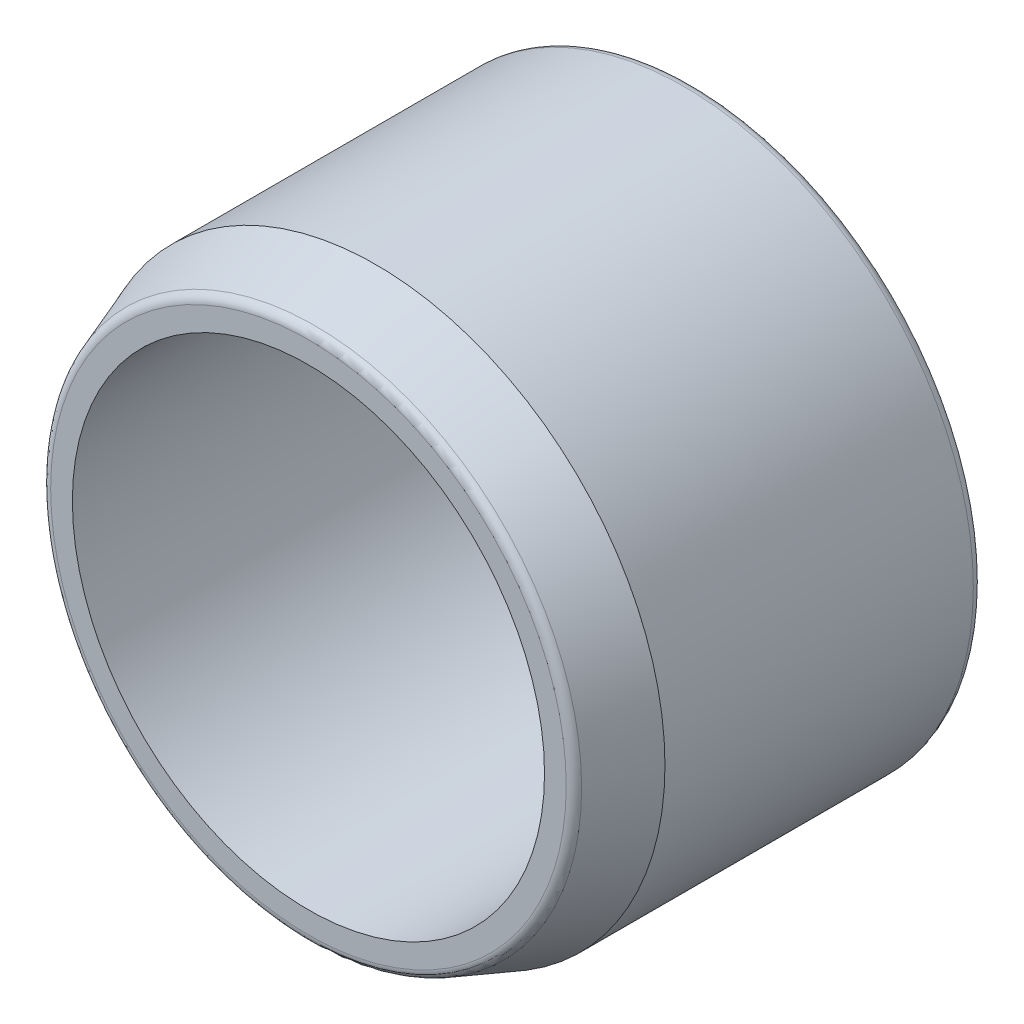
ISO-10303-21;
HEADER;
FILE_DESCRIPTION(('STEP AP214'),'2;1');
FILE_NAME('part.step','',(''),(''),'','','');
FILE_SCHEMA(('AUTOMOTIVE_DESIGN { 1 0 10303 214 1 1 1 1 }'));
ENDSEC;
DATA;
#1=APPLICATION_CONTEXT('core data for automotive mechanical design processes');
#2=APPLICATION_PROTOCOL_DEFINITION('international standard','automotive_design',2000,#1);
#3=PRODUCT_CONTEXT('',#1,'mechanical');
#4=PRODUCT('Part','Part','',(#3));
#5=PRODUCT_RELATED_PRODUCT_CATEGORY('part','',(#4));
#6=PRODUCT_DEFINITION_FORMATION('','',#4);
#7=PRODUCT_DEFINITION_CONTEXT('part definition',#1,'design');
#8=PRODUCT_DEFINITION('design','',#6,#7);
#9=PRODUCT_DEFINITION_SHAPE('','',#8);
#10=(LENGTH_UNIT() NAMED_UNIT(*) SI_UNIT(.MILLI.,.METRE.));
#11=(NAMED_UNIT(*) PLANE_ANGLE_UNIT() SI_UNIT($,.RADIAN.));
#12=(NAMED_UNIT(*) SI_UNIT($,.STERADIAN.) SOLID_ANGLE_UNIT());
#13=UNCERTAINTY_MEASURE_WITH_UNIT(LENGTH_MEASURE(1.E-05),#10,'distance_accuracy_value','');
#14=(GEOMETRIC_REPRESENTATION_CONTEXT(3) GLOBAL_UNCERTAINTY_ASSIGNED_CONTEXT((#13)) GLOBAL_UNIT_ASSIGNED_CONTEXT((#10,
#11,#12)) REPRESENTATION_CONTEXT('',''));
#15=CARTESIAN_POINT('',(0.,0.,0.));
#16=DIRECTION('',(0.,0.,1.));
#17=DIRECTION('',(1.,0.,0.));
#18=AXIS2_PLACEMENT_3D('',#15,#16,#17);
#19=CARTESIAN_POINT('',(0.,0.,40.));
#20=DIRECTION('',(0.,0.,1.));
#21=DIRECTION('',(1.,0.,0.));
#22=AXIS2_PLACEMENT_3D('',#19,#20,#21);
#23=PLANE('',#22);
#24=CARTESIAN_POINT('',(0.,0.,40.));
#25=DIRECTION('',(0.,0.,1.));
#26=DIRECTION('',(1.,0.,0.));
#27=AXIS2_PLACEMENT_3D('',#24,#25,#26);
#28=CIRCLE('',#27,26.7520008219269);
#29=CARTESIAN_POINT('',(26.7520008219269,0.,40.));
#30=VERTEX_POINT('',#29);
#31=EDGE_CURVE('E39',#30,#30,#28,.T.);
#32=ORIENTED_EDGE('',*,*,#31,.T.);
#33=EDGE_LOOP('',(#32));
#34=FACE_BOUND('',#33,.T.);
#35=CARTESIAN_POINT('',(0.,0.,40.));
#36=DIRECTION('',(0.,0.,1.));
#37=DIRECTION('',(1.,0.,0.));
#38=AXIS2_PLACEMENT_3D('',#35,#36,#37);
#39=CIRCLE('',#38,24.5);
#40=CARTESIAN_POINT('',(24.5,0.,40.));
#41=VERTEX_POINT('',#40);
#42=EDGE_CURVE('E55',#41,#41,#39,.T.);
#43=ORIENTED_EDGE('',*,*,#42,.F.);
#44=EDGE_LOOP('',(#43));
#45=FACE_BOUND('',#44,.T.);
#46=ADVANCED_FACE('F32',(#34,#45),#23,.T.);
#47=CARTESIAN_POINT('',(0.,0.,0.));
#48=DIRECTION('',(0.,0.,1.));
#49=DIRECTION('',(1.,0.,0.));
#50=AXIS2_PLACEMENT_3D('',#47,#48,#49);
#51=PLANE('',#50);
#52=CARTESIAN_POINT('',(0.,0.,0.));
#53=DIRECTION('',(0.,0.,1.));
#54=DIRECTION('',(1.,0.,0.));
#55=AXIS2_PLACEMENT_3D('',#52,#53,#54);
#56=CIRCLE('',#55,29.);
#57=CARTESIAN_POINT('',(29.,0.,0.));
#58=VERTEX_POINT('',#57);
#59=EDGE_CURVE('E43',#58,#58,#56,.F.);
#60=ORIENTED_EDGE('',*,*,#59,.T.);
#61=EDGE_LOOP('',(#60));
#62=FACE_BOUND('',#61,.T.);
#63=CARTESIAN_POINT('',(0.,0.,0.));
#64=DIRECTION('',(0.,0.,1.));
#65=DIRECTION('',(1.,0.,0.));
#66=AXIS2_PLACEMENT_3D('',#63,#64,#65);
#67=CIRCLE('',#66,24.5);
#68=CARTESIAN_POINT('',(24.5,0.,0.));
#69=VERTEX_POINT('',#68);
#70=EDGE_CURVE('E56',#69,#69,#67,.T.);
#71=ORIENTED_EDGE('',*,*,#70,.T.);
#72=EDGE_LOOP('',(#71));
#73=FACE_BOUND('',#72,.T.);
#74=ADVANCED_FACE('F66',(#62,#73),#51,.F.);
#75=CARTESIAN_POINT('',(0.,0.,40.));
#76=DIRECTION('',(0.,0.,-1.));
#77=DIRECTION('',(-1.,0.,0.));
#78=AXIS2_PLACEMENT_3D('',#75,#76,#77);
#79=CYLINDRICAL_SURFACE('',#78,30.);
#80=CARTESIAN_POINT('',(0.,0.,1.));
#81=DIRECTION('',(0.,0.,1.));
#82=DIRECTION('',(1.,0.,0.));
#83=AXIS2_PLACEMENT_3D('',#80,#81,#82);
#84=CIRCLE('',#83,30.);
#85=CARTESIAN_POINT('',(30.,0.,1.));
#86=VERTEX_POINT('',#85);
#87=EDGE_CURVE('E47',#86,#86,#84,.T.);
#88=ORIENTED_EDGE('',*,*,#87,.T.);
#89=EDGE_LOOP('',(#88));
#90=FACE_BOUND('',#89,.T.);
#91=CARTESIAN_POINT('',(0.,0.,32.9999999999999));
#92=DIRECTION('',(0.,0.,1.));
#93=DIRECTION('',(1.,0.,0.));
#94=AXIS2_PLACEMENT_3D('',#91,#92,#93);
#95=CIRCLE('',#94,30.);
#96=CARTESIAN_POINT('',(30.,0.,32.9999999999999));
#97=VERTEX_POINT('',#96);
#98=EDGE_CURVE('E52',#97,#97,#95,.F.);
#99=ORIENTED_EDGE('',*,*,#98,.T.);
#100=EDGE_LOOP('',(#99));
#101=FACE_BOUND('',#100,.T.);
#102=ADVANCED_FACE('F71',(#90,#101),#79,.T.);
#103=CARTESIAN_POINT('',(0.,0.,40.));
#104=DIRECTION('',(0.,0.,-1.));
#105=DIRECTION('',(-1.,0.,0.));
#106=AXIS2_PLACEMENT_3D('',#103,#104,#105);
#107=CYLINDRICAL_SURFACE('',#106,24.5);
#108=ORIENTED_EDGE('',*,*,#42,.T.);
#109=EDGE_LOOP('',(#108));
#110=FACE_BOUND('',#109,.T.);
#111=ORIENTED_EDGE('',*,*,#70,.F.);
#112=EDGE_LOOP('',(#111));
#113=FACE_BOUND('',#112,.T.);
#114=ADVANCED_FACE('F62',(#110,#113),#107,.F.);
#115=CARTESIAN_POINT('',(0.,0.,40.));
#116=DIRECTION('',(0.,0.,-1.));
#117=DIRECTION('',(-1.,0.,0.));
#118=AXIS2_PLACEMENT_3D('',#115,#116,#117);
#119=CONICAL_SURFACE('',#118,27.4522083601366,0.349065850398863);
#120=CARTESIAN_POINT('',(0.,0.,39.3420201433257));
#121=DIRECTION('',(0.,0.,1.));
#122=DIRECTION('',(1.,0.,0.));
#123=AXIS2_PLACEMENT_3D('',#120,#121,#122);
#124=CIRCLE('',#123,27.6916934427128);
#125=CARTESIAN_POINT('',(27.6916934427128,0.,39.3420201433257));
#126=VERTEX_POINT('',#125);
#127=EDGE_CURVE('E10',#126,#126,#124,.F.);
#128=ORIENTED_EDGE('',*,*,#127,.T.);
#129=EDGE_LOOP('',(#128));
#130=FACE_BOUND('',#129,.T.);
#131=ORIENTED_EDGE('',*,*,#98,.F.);
#132=EDGE_LOOP('',(#131));
#133=FACE_BOUND('',#132,.T.);
#134=ADVANCED_FACE('F79',(#130,#133),#119,.T.);
#135=CARTESIAN_POINT('',(0.,0.,1.));
#136=DIRECTION('',(0.,0.,1.));
#137=DIRECTION('',(1.,0.,0.));
#138=AXIS2_PLACEMENT_3D('',#135,#136,#137);
#139=TOROIDAL_SURFACE('',#138,29.,1.);
#140=ORIENTED_EDGE('',*,*,#59,.F.);
#141=EDGE_LOOP('',(#140));
#142=FACE_BOUND('',#141,.T.);
#143=ORIENTED_EDGE('',*,*,#87,.F.);
#144=EDGE_LOOP('',(#143));
#145=FACE_BOUND('',#144,.T.);
#146=ADVANCED_FACE('F81',(#142,#145),#139,.T.);
#147=CARTESIAN_POINT('',(0.,0.,39.));
#148=DIRECTION('',(0.,0.,1.));
#149=DIRECTION('',(1.,0.,0.));
#150=AXIS2_PLACEMENT_3D('',#147,#148,#149);
#151=TOROIDAL_SURFACE('',#150,26.7520008219269,1.);
#152=ORIENTED_EDGE('',*,*,#127,.F.);
#153=EDGE_LOOP('',(#152));
#154=FACE_BOUND('',#153,.T.);
#155=ORIENTED_EDGE('',*,*,#31,.F.);
#156=EDGE_LOOP('',(#155));
#157=FACE_BOUND('',#156,.T.);
#158=ADVANCED_FACE('F34',(#154,#157),#151,.T.);
#159=CLOSED_SHELL('',(#46,#74,#102,#114,#134,#146,#158));
#160=MANIFOLD_SOLID_BREP('B2',#159);
#161=ADVANCED_BREP_SHAPE_REPRESENTATION('',(#18,#160),#14);
#162=SHAPE_DEFINITION_REPRESENTATION(#9,#161);
ENDSEC;
END-ISO-10303-21;
